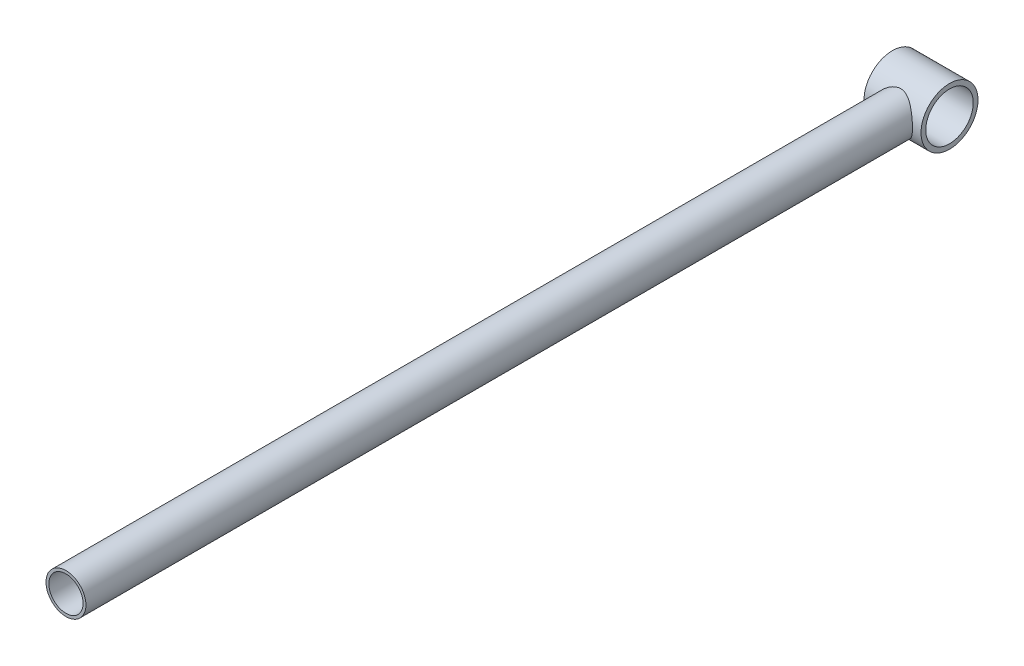
ISO-10303-21;
HEADER;
FILE_DESCRIPTION(('STEP AP214'),'2;1');
FILE_NAME('part.step','',(''),(''),'','','');
FILE_SCHEMA(('AUTOMOTIVE_DESIGN { 1 0 10303 214 1 1 1 1 }'));
ENDSEC;
DATA;
#1=APPLICATION_CONTEXT('core data for automotive mechanical design processes');
#2=APPLICATION_PROTOCOL_DEFINITION('international standard','automotive_design',2000,#1);
#3=PRODUCT_CONTEXT('',#1,'mechanical');
#4=PRODUCT('Part','Part','',(#3));
#5=PRODUCT_RELATED_PRODUCT_CATEGORY('part','',(#4));
#6=PRODUCT_DEFINITION_FORMATION('','',#4);
#7=PRODUCT_DEFINITION_CONTEXT('part definition',#1,'design');
#8=PRODUCT_DEFINITION('design','',#6,#7);
#9=PRODUCT_DEFINITION_SHAPE('','',#8);
#10=(LENGTH_UNIT() NAMED_UNIT(*) SI_UNIT(.MILLI.,.METRE.));
#11=(NAMED_UNIT(*) PLANE_ANGLE_UNIT() SI_UNIT($,.RADIAN.));
#12=(NAMED_UNIT(*) SI_UNIT($,.STERADIAN.) SOLID_ANGLE_UNIT());
#13=UNCERTAINTY_MEASURE_WITH_UNIT(LENGTH_MEASURE(1.E-05),#10,'distance_accuracy_value','');
#14=(GEOMETRIC_REPRESENTATION_CONTEXT(3) GLOBAL_UNCERTAINTY_ASSIGNED_CONTEXT((#13)) GLOBAL_UNIT_ASSIGNED_CONTEXT((#10,
#11,#12)) REPRESENTATION_CONTEXT('',''));
#15=CARTESIAN_POINT('',(0.,0.,0.));
#16=DIRECTION('',(0.,0.,1.));
#17=DIRECTION('',(1.,0.,0.));
#18=AXIS2_PLACEMENT_3D('',#15,#16,#17);
#19=CARTESIAN_POINT('',(0.,0.,900.));
#20=DIRECTION('',(0.,0.,-1.));
#21=DIRECTION('',(-1.,0.,0.));
#22=AXIS2_PLACEMENT_3D('',#19,#20,#21);
#23=CYLINDRICAL_SURFACE('',#22,21.);
#24=CARTESIAN_POINT('',(0.,0.,900.));
#25=DIRECTION('',(0.,0.,1.));
#26=DIRECTION('',(1.,0.,0.));
#27=AXIS2_PLACEMENT_3D('',#24,#25,#26);
#28=CIRCLE('',#27,21.);
#29=CARTESIAN_POINT('',(21.,0.,900.));
#30=VERTEX_POINT('',#29);
#31=EDGE_CURVE('E49',#30,#30,#28,.T.);
#32=ORIENTED_EDGE('',*,*,#31,.F.);
#33=EDGE_LOOP('',(#32));
#34=FACE_BOUND('',#33,.T.);
#35=CARTESIAN_POINT('',(-21.,0.,30.));
#36=CARTESIAN_POINT('',(-21.0000030016786,0.522139363504642,30.0000028096005));
#37=CARTESIAN_POINT('',(-20.9805018033482,1.04424378297232,29.9863417700638));
#38=CARTESIAN_POINT('',(-20.9028288134405,2.08411304662802,29.9320475904379));
#39=CARTESIAN_POINT('',(-20.8446603803,2.60187826374233,29.8914167928032));
#40=CARTESIAN_POINT('',(-20.6905610723578,3.62912317980961,29.7841613040893));
#41=CARTESIAN_POINT('',(-20.5946210870993,4.13860084892023,29.7175303418333));
#42=CARTESIAN_POINT('',(-20.3664086236415,5.14547395896201,29.5598342669698));
#43=CARTESIAN_POINT('',(-20.2341348878992,5.64286898105352,29.4687683086481));
#44=CARTESIAN_POINT('',(-19.9357924443592,6.61995875788221,29.2647235126369));
#45=CARTESIAN_POINT('',(-19.7698941299359,7.09972889319108,29.1518552887538));
#46=CARTESIAN_POINT('',(-19.4058767180977,8.04157152857023,28.9062278826493));
#47=CARTESIAN_POINT('',(-19.2077579437734,8.50364420604434,28.7734688998834));
#48=CARTESIAN_POINT('',(-18.7813353764875,9.4080499838005,28.4905792567296));
#49=CARTESIAN_POINT('',(-18.5530327874011,9.85038387041943,28.3404492892095));
#50=CARTESIAN_POINT('',(-18.0681803671967,10.7138264742398,28.0254380267442));
#51=CARTESIAN_POINT('',(-17.8116270203184,11.1349325401461,27.8605548962719));
#52=CARTESIAN_POINT('',(-17.2482943142261,11.9908926807694,27.5036730841839));
#53=CARTESIAN_POINT('',(-16.9390806650561,12.4236816666953,27.3105655343889));
#54=CARTESIAN_POINT('',(-16.2914367781881,13.2615808482145,26.9136660373409));
#55=CARTESIAN_POINT('',(-15.9530051566134,13.6666897311409,26.7098735841891));
#56=CARTESIAN_POINT('',(-15.2481596682265,14.4489165067027,26.2949628574189));
#57=CARTESIAN_POINT('',(-14.8817076195985,14.8259947733449,26.083834809561));
#58=CARTESIAN_POINT('',(-14.1226090530107,15.5507992372147,25.6583180799881));
#59=CARTESIAN_POINT('',(-13.729961024889,15.8985237396161,25.4439292108423));
#60=CARTESIAN_POINT('',(-12.8480727758939,16.6224949517664,24.9781707294449));
#61=CARTESIAN_POINT('',(-12.354002345993,16.9929738905183,24.7269402090807));
#62=CARTESIAN_POINT('',(-11.3322354242131,17.690770722502,24.2326130950016));
#63=CARTESIAN_POINT('',(-10.8045302608075,18.0180774179922,23.9895186237167));
#64=CARTESIAN_POINT('',(-9.71715664456965,18.6269818359532,23.5198450086047));
#65=CARTESIAN_POINT('',(-9.15753065407967,18.9086384514908,23.2932447969889));
#66=CARTESIAN_POINT('',(-8.29509013603358,19.294834597165,22.9725363785782));
#67=CARTESIAN_POINT('',(-8.00382784209581,19.4175007456437,22.8688482187721));
#68=CARTESIAN_POINT('',(-7.41371076354774,19.6503825262825,22.6690535406029));
#69=CARTESIAN_POINT('',(-7.11485421500728,19.7605952328771,22.5729488053327));
#70=CARTESIAN_POINT('',(-6.39612362173446,20.0070791920212,22.3551581744265));
#71=CARTESIAN_POINT('',(-5.97302255802356,20.1375536535112,22.2374516540968));
#72=CARTESIAN_POINT('',(-5.11468671401496,20.3724784759791,22.0224319526899));
#73=CARTESIAN_POINT('',(-4.67945558084695,20.4769365673737,21.925112715173));
#74=CARTESIAN_POINT('',(-3.79939196121188,20.65831771735,21.7542972490663));
#75=CARTESIAN_POINT('',(-3.35457615063467,20.7352850578524,21.6807627264235));
#76=CARTESIAN_POINT('',(-2.45734056009086,20.8606477258805,21.5601713050939));
#77=CARTESIAN_POINT('',(-2.00492079720528,20.9090431175797,21.5131143469377));
#78=CARTESIAN_POINT('',(-1.09315844954929,20.9765380721417,21.4473103354131));
#79=CARTESIAN_POINT('',(-0.633790900793574,20.9954655353593,21.4287295996627));
#80=CARTESIAN_POINT('',(0.285438297298884,21.0030898024577,21.4212569782211));
#81=CARTESIAN_POINT('',(0.74529994480372,20.9917867180363,21.4323649828341));
#82=CARTESIAN_POINT('',(1.66190989374096,20.9391724994902,21.4837702004158));
#83=CARTESIAN_POINT('',(2.11865617281979,20.8978434563318,21.5240848336873));
#84=CARTESIAN_POINT('',(3.02523827126227,20.7859705480368,21.632138936961));
#85=CARTESIAN_POINT('',(3.47507394681526,20.7154260757748,21.6998789768896));
#86=CARTESIAN_POINT('',(4.33532127559099,20.5519778005734,21.8547011059896));
#87=CARTESIAN_POINT('',(4.7463658811044,20.4608720169539,21.9401981370793));
#88=CARTESIAN_POINT('',(5.55828066479709,20.2553932784216,22.1300383090195));
#89=CARTESIAN_POINT('',(5.959147043663,20.1410117747261,22.2343883726898));
#90=CARTESIAN_POINT('',(6.74949919036072,19.8901050092372,22.4591199814558));
#91=CARTESIAN_POINT('',(7.13897869769433,19.7535678267552,22.5795101505298));
#92=CARTESIAN_POINT('',(7.90540017899447,19.4595251934198,22.8334102113169));
#93=CARTESIAN_POINT('',(8.2823440694059,19.3020229662918,22.9669180851392));
#94=CARTESIAN_POINT('',(9.21983705503104,18.8780790475413,23.3179932659974));
#95=CARTESIAN_POINT('',(9.77171796608896,18.5981674550038,23.5425843204367));
#96=CARTESIAN_POINT('',(10.8438857080031,17.9941389131174,24.0074221440567));
#97=CARTESIAN_POINT('',(11.3641595085085,17.6700039085722,24.2476752866055));
#98=CARTESIAN_POINT('',(12.3729032339043,16.9789766443065,24.7364869213433));
#99=CARTESIAN_POINT('',(12.861314417595,16.6120087082098,24.9850595424287));
#100=CARTESIAN_POINT('',(13.8040207225899,15.837334919501,25.4831492444279));
#101=CARTESIAN_POINT('',(14.2583201989205,15.429634282757,25.7326662004917));
#102=CARTESIAN_POINT('',(15.136441554028,14.5694995976463,26.229358403613));
#103=CARTESIAN_POINT('',(15.5598320196401,14.1165872352544,26.4764695667978));
#104=CARTESIAN_POINT('',(16.3676492082307,13.1714310594696,26.9591370786845));
#105=CARTESIAN_POINT('',(16.7520723023711,12.6791835906127,27.1946923501915));
#106=CARTESIAN_POINT('',(17.4782461801882,11.6577286804088,27.647943464369));
#107=CARTESIAN_POINT('',(17.8200725721641,11.1285894028624,27.8656707088055));
#108=CARTESIAN_POINT('',(18.2984438720732,10.3085943701031,28.1747814447172));
#109=CARTESIAN_POINT('',(18.452163522779,10.0309016978793,28.2748987097707));
#110=CARTESIAN_POINT('',(18.7477441015681,9.46696671750889,28.4686747347568));
#111=CARTESIAN_POINT('',(18.8896020017362,9.18072225152697,28.5623318445623));
#112=CARTESIAN_POINT('',(19.236502252626,8.43835836584836,28.7926731907843));
#113=CARTESIAN_POINT('',(19.4327037015834,7.97646237276238,28.9242514064532));
#114=CARTESIAN_POINT('',(19.7928905534157,7.03529153377132,29.1674626727303));
#115=CARTESIAN_POINT('',(19.9568824536785,6.55602021601318,29.2790997455017));
#116=CARTESIAN_POINT('',(20.2506998866761,5.58277389644747,29.480152102592));
#117=CARTESIAN_POINT('',(20.3805413949854,5.0888058905733,29.5695777763237));
#118=CARTESIAN_POINT('',(20.6044138323331,4.08907213293505,29.7243220362663));
#119=CARTESIAN_POINT('',(20.6984440326398,3.58330614131359,29.7896401319064));
#120=CARTESIAN_POINT('',(20.8496160317771,2.56150542084761,29.894874568425));
#121=CARTESIAN_POINT('',(20.9066046375167,2.0454370320149,29.9346854092819));
#122=CARTESIAN_POINT('',(20.9821729740576,1.0091186162172,29.9875115613899));
#123=CARTESIAN_POINT('',(21.0007527110704,0.488868589928469,30.0005268769744));
#124=CARTESIAN_POINT('',(20.9992005482234,-0.551528121854273,29.9994404045402));
#125=CARTESIAN_POINT('',(20.9790697363269,-1.07167480984172,29.9853393786286));
#126=CARTESIAN_POINT('',(20.9004258925435,-2.10760905173202,29.9303693639773));
#127=CARTESIAN_POINT('',(20.8419142396888,-2.62339676157953,29.889501336982));
#128=CARTESIAN_POINT('',(20.6924977935693,-3.61308880982631,29.7855132567241));
#129=CARTESIAN_POINT('',(20.6039617209437,-4.08752624893559,29.7240232475498));
#130=CARTESIAN_POINT('',(20.3953347128018,-5.0260730366639,29.5797903571606));
#131=CARTESIAN_POINT('',(20.2752454400586,-5.49018292812081,29.497048595864));
#132=CARTESIAN_POINT('',(20.0049238976076,-6.4055288270512,29.3118966579764));
#133=CARTESIAN_POINT('',(19.8546891099268,-6.85676375551546,29.2094848384296));
#134=CARTESIAN_POINT('',(19.5256728492025,-7.74416402227739,28.9868458709253));
#135=CARTESIAN_POINT('',(19.3468897936758,-8.1803285235623,28.8666177354031));
#136=CARTESIAN_POINT('',(18.9488548103376,-9.06603463904474,28.6013207239606));
#137=CARTESIAN_POINT('',(18.727636628259,-9.51434581809408,28.4550972121009));
#138=CARTESIAN_POINT('',(18.256384470974,-10.3899799262107,28.1471802744837));
#139=CARTESIAN_POINT('',(18.0063494396476,-10.8173020852242,27.9854862817795));
#140=CARTESIAN_POINT('',(17.4792195087191,-11.6498827956824,27.6492654799792));
#141=CARTESIAN_POINT('',(17.2021125826037,-12.0551314154441,27.4747329760417));
#142=CARTESIAN_POINT('',(16.6225878658483,-12.8424515914298,27.115654093724));
#143=CARTESIAN_POINT('',(16.3201670993105,-13.2245204135021,26.9311065388728));
#144=CARTESIAN_POINT('',(15.637707186282,-14.0280238180896,26.5226477926847));
#145=CARTESIAN_POINT('',(15.2532368962608,-14.4450231309386,26.2974004065562));
#146=CARTESIAN_POINT('',(14.4534314724557,-15.2452758647429,25.8417033982012));
#147=CARTESIAN_POINT('',(14.0380919072556,-15.6285244233128,25.6112530323835));
#148=CARTESIAN_POINT('',(13.1776643009478,-16.360577068066,25.1499268775914));
#149=CARTESIAN_POINT('',(12.7325534631647,-16.7093542403453,24.9190508973492));
#150=CARTESIAN_POINT('',(11.8139446786733,-17.3709836244724,24.4624291437159));
#151=CARTESIAN_POINT('',(11.3404499563073,-17.6838399051218,24.2366827916138));
#152=CARTESIAN_POINT('',(10.4125110066118,-18.2440275445785,23.8173448179944));
#153=CARTESIAN_POINT('',(9.9605791901329,-18.4947642720405,23.622743337259));
#154=CARTESIAN_POINT('',(9.03472270692457,-18.9642600857899,23.2475190279739));
#155=CARTESIAN_POINT('',(8.56079746938568,-19.1830183415071,23.0668965625555));
#156=CARTESIAN_POINT('',(7.5926617008033,-19.5863736781477,22.7253980131195));
#157=CARTESIAN_POINT('',(7.09848473144647,-19.7710246911012,22.5644908922822));
#158=CARTESIAN_POINT('',(6.0907452984859,-20.1043337565574,22.2680395809845));
#159=CARTESIAN_POINT('',(5.57718809221115,-20.2530014903564,22.1324885707004));
#160=CARTESIAN_POINT('',(4.6389198553431,-20.4857140606324,21.9170100309722));
#161=CARTESIAN_POINT('',(4.21724652364094,-20.5767476056501,21.8313773767555));
#162=CARTESIAN_POINT('',(3.36519645784325,-20.7331369070813,21.6829127076127));
#163=CARTESIAN_POINT('',(2.93482084964832,-20.7984959631903,21.6200777627953));
#164=CARTESIAN_POINT('',(2.06839032609777,-20.9024378178356,21.519603758078));
#165=CARTESIAN_POINT('',(1.6323422125398,-20.941050126998,21.4819369309395));
#166=CARTESIAN_POINT('',(0.757177305160306,-20.990920927013,21.4332096217729));
#167=CARTESIAN_POINT('',(0.318060480902294,-21.0021791461715,21.4221494040144));
#168=CARTESIAN_POINT('',(-0.560383803578687,-20.9971217966341,21.4271063691283));
#169=CARTESIAN_POINT('',(-0.999710889621124,-20.9807733000154,21.4431558871568));
#170=CARTESIAN_POINT('',(-1.87468784242075,-20.9207521129018,21.5017177088797));
#171=CARTESIAN_POINT('',(-2.31033773156066,-20.8770795888472,21.5442298513808));
#172=CARTESIAN_POINT('',(-3.17549794973413,-20.7631126204946,21.6540848459456));
#173=CARTESIAN_POINT('',(-3.60499989404334,-20.6927848586031,21.7214587710885));
#174=CARTESIAN_POINT('',(-4.45486414474633,-20.5266109606012,21.8785573791153));
#175=CARTESIAN_POINT('',(-4.87522522731318,-20.4307614299789,21.9682850350453));
#176=CARTESIAN_POINT('',(-5.82218439689123,-20.1842612618693,22.195293271751));
#177=CARTESIAN_POINT('',(-6.34524883185518,-20.0257787123513,22.3388467699985));
#178=CARTESIAN_POINT('',(-7.37069852021808,-19.6714855305921,22.651454535761));
#179=CARTESIAN_POINT('',(-7.8730774130996,-19.4756635196791,22.8205165733556));
#180=CARTESIAN_POINT('',(-8.85615081096811,-19.0487822705998,23.1780385843898));
#181=CARTESIAN_POINT('',(-9.33681899969305,-18.817681680812,23.3665212362249));
#182=CARTESIAN_POINT('',(-10.2749199541703,-18.3223196009062,23.7569368799941));
#183=CARTESIAN_POINT('',(-10.7323540793603,-18.0580600540838,23.9588690833859));
#184=CARTESIAN_POINT('',(-11.633977181546,-17.4911647214488,24.375928795016));
#185=CARTESIAN_POINT('',(-12.0775938088268,-17.1877667390505,24.5912557642087));
#186=CARTESIAN_POINT('',(-12.9391353264947,-16.5489086065067,25.0256439438005));
#187=CARTESIAN_POINT('',(-13.3570603447144,-16.2134486159118,25.2447051356125));
#188=CARTESIAN_POINT('',(-14.1664241146984,-15.5112705037231,25.6821266605216));
#189=CARTESIAN_POINT('',(-14.5578552209222,-15.1445434275675,25.9004867741327));
#190=CARTESIAN_POINT('',(-15.3128761722056,-14.3806899507618,26.3322672598208));
#191=CARTESIAN_POINT('',(-15.6764630372895,-13.9835603054054,26.545687101474));
#192=CARTESIAN_POINT('',(-16.438475496301,-13.0837742184306,27.0021103117724));
#193=CARTESIAN_POINT('',(-16.8309782931605,-12.5751557375068,27.2433198671589));
#194=CARTESIAN_POINT('',(-17.571287916976,-11.5180814795311,27.7068022474635));
#195=CARTESIAN_POINT('',(-17.9190879862317,-10.9696196989461,27.92907220758));
#196=CARTESIAN_POINT('',(-18.5655925322006,-9.83586246046007,28.3482048450996));
#197=CARTESIAN_POINT('',(-18.8643381285387,-9.25059842692598,28.5450887721546));
#198=CARTESIAN_POINT('',(-19.4084807931639,-8.04654966069242,28.9075758155444));
#199=CARTESIAN_POINT('',(-19.6538929268033,-7.42777445590566,29.0731877636833));
#200=CARTESIAN_POINT('',(-20.0541832050944,-6.25721006317298,29.3453941761765));
#201=CARTESIAN_POINT('',(-20.217129527181,-5.7093653473698,29.4571204218519));
#202=CARTESIAN_POINT('',(-20.4986366716474,-4.59725305414212,29.6510314454142));
#203=CARTESIAN_POINT('',(-20.6172021189562,-4.03298719457284,29.7332193014598));
#204=CARTESIAN_POINT('',(-20.8077082327473,-2.8935417141935,29.8656330167248));
#205=CARTESIAN_POINT('',(-20.8796983715023,-2.3183743438364,29.9158927889105));
#206=CARTESIAN_POINT('',(-20.9758405302026,-1.16212321643655,29.9830732852714));
#207=CARTESIAN_POINT('',(-20.9999966597131,-0.581039971956366,29.9999968734589));
#208=CARTESIAN_POINT('',(-21.,0.,30.));
#209=B_SPLINE_CURVE_WITH_KNOTS('',3,(#35,#36,#37,#38,#39,#40,#41,#42,#43,#44,#45,#46,#47,#48,
#49,#50,#51,#52,#53,#54,#55,#56,#57,#58,#59,#60,#61,#62,#63,#64,#65,#66,#67,#68,#69,#70,#71,#72,
#73,#74,#75,#76,#77,#78,#79,#80,#81,#82,#83,#84,#85,#86,#87,#88,#89,#90,#91,#92,#93,#94,#95,#96,
#97,#98,#99,#100,#101,#102,#103,#104,#105,#106,#107,#108,#109,#110,#111,#112,#113,#114,#115,
#116,#117,#118,#119,#120,#121,#122,#123,#124,#125,#126,#127,#128,#129,#130,#131,#132,#133,#134,
#135,#136,#137,#138,#139,#140,#141,#142,#143,#144,#145,#146,#147,#148,#149,#150,#151,#152,#153,
#154,#155,#156,#157,#158,#159,#160,#161,#162,#163,#164,#165,#166,#167,#168,#169,#170,#171,#172,
#173,#174,#175,#176,#177,#178,#179,#180,#181,#182,#183,#184,#185,#186,#187,#188,#189,#190,#191,
#192,#193,#194,#195,#196,#197,#198,#199,#200,#201,#202,#203,#204,#205,#206,#207,#208),
.UNSPECIFIED.,.T.,.F.,(4,2,2,2,2,2,2,2,2,2,2,2,2,2,2,2,2,2,2,2,2,2,2,2,2,2,2,2,2,2,2,2,2,2,2,2,
2,2,2,2,2,2,2,2,2,2,2,2,2,2,2,2,2,2,2,2,2,2,2,2,2,2,2,2,2,2,2,2,2,2,2,2,2,2,2,2,2,2,2,2,2,2,2,2,
2,2,4),(0.,1.56582024750205,3.13150451369805,4.69756665280387,6.26368300152248,7.82205299786193,
9.38040736861309,10.9386996034686,12.4971859848665,14.1931766310765,15.8892476501058,
17.5876724684341,19.2861952833561,21.2839576357884,23.2822371404197,25.277917788053,
26.2754190251758,27.273154110473,28.6462722944093,30.0189819865594,31.3894704476345,
32.7599558305455,34.1384155406343,35.5168701575093,36.8961476316751,38.2754537700303,
39.5630726172669,40.8511652417266,42.1399532263754,43.4285432668102,45.400654858582,
47.3735740318977,49.3500332420786,51.3262396880363,53.326173164234,55.3262927135487,
57.3228099321013,58.3209311028378,59.3193062882042,60.8740223522875,62.4284244724651,
63.9820981438221,65.5358034295109,67.0958941713692,68.6559846609343,70.2160313046693,
71.7760218986512,73.233991228657,74.6918837428041,76.1498980814791,77.6079932686481,
79.1690559350298,80.7301758316071,82.2919924267384,83.8539928877606,85.6830054219923,
87.5122810278116,89.3429737609573,91.1734589243873,92.8287910433424,94.4841661482588,
96.1369008565309,97.7891904012264,99.1073078836029,100.425255905521,101.741747462918,
103.058252096299,104.376328100557,105.694396076029,107.014117027125,108.334013594893,
110.026762482734,111.720028038594,113.415293807604,115.110460271164,116.845875110838,
118.581281314986,120.317186201332,122.053276610644,124.109220019975,126.165473861134,
128.219995161816,130.273935355749,132.018577587401,133.763037959312,135.505642310654,
137.248096943055),.UNSPECIFIED.);
#210=CARTESIAN_POINT('',(-21.,0.,30.));
#211=VERTEX_POINT('',#210);
#212=EDGE_CURVE('E10',#211,#211,#209,.T.);
#213=ORIENTED_EDGE('',*,*,#212,.F.);
#214=EDGE_LOOP('',(#213));
#215=FACE_BOUND('',#214,.T.);
#216=ADVANCED_FACE('F33',(#34,#215),#23,.T.);
#217=CARTESIAN_POINT('',(0.,0.,900.));
#218=DIRECTION('',(0.,0.,-1.));
#219=DIRECTION('',(-1.,0.,0.));
#220=AXIS2_PLACEMENT_3D('',#217,#218,#219);
#221=CYLINDRICAL_SURFACE('',#220,18.);
#222=CARTESIAN_POINT('',(0.,0.,900.));
#223=DIRECTION('',(0.,0.,-1.));
#224=DIRECTION('',(-1.,0.,0.));
#225=AXIS2_PLACEMENT_3D('',#222,#223,#224);
#226=CIRCLE('',#225,18.);
#227=CARTESIAN_POINT('',(-18.,0.,900.));
#228=VERTEX_POINT('',#227);
#229=EDGE_CURVE('E56',#228,#228,#226,.T.);
#230=ORIENTED_EDGE('',*,*,#229,.F.);
#231=EDGE_LOOP('',(#230));
#232=FACE_BOUND('',#231,.T.);
#233=CARTESIAN_POINT('',(-18.,0.,30.));
#234=CARTESIAN_POINT('',(-17.999996247715,-0.4606123178426,29.9999965033915));
#235=CARTESIAN_POINT('',(-17.9822921362072,-0.921341104850186,29.9893649266002));
#236=CARTESIAN_POINT('',(-17.911700896493,-1.83932264715951,29.9470908900286));
#237=CARTESIAN_POINT('',(-17.8587931824861,-2.29657321019135,29.9154361366709));
#238=CARTESIAN_POINT('',(-17.7183641285956,-3.20487010694028,29.8318158697663));
#239=CARTESIAN_POINT('',(-17.6307675458938,-3.65590073368428,29.7798062077528));
#240=CARTESIAN_POINT('',(-17.4221309636962,-4.54740994379331,29.6567624509548));
#241=CARTESIAN_POINT('',(-17.3010955154834,-4.98788995431719,29.5857309452278));
#242=CARTESIAN_POINT('',(-17.0277165263829,-5.85335853126847,29.4267027939977));
#243=CARTESIAN_POINT('',(-16.8755318341814,-6.27841329800556,29.3387923598966));
#244=CARTESIAN_POINT('',(-16.5410982375724,-7.11295835128677,29.1477117701425));
#245=CARTESIAN_POINT('',(-16.358848421334,-7.5224481653053,29.0445411516805));
#246=CARTESIAN_POINT('',(-15.9660494100785,-8.32371793921731,28.8251315609232));
#247=CARTESIAN_POINT('',(-15.7555121728485,-8.71550528936686,28.7088981139832));
#248=CARTESIAN_POINT('',(-15.3077111611957,-9.47999294803696,28.4656053285681));
#249=CARTESIAN_POINT('',(-15.0704446260552,-9.85269127916741,28.3385448721631));
#250=CARTESIAN_POINT('',(-14.5516473760924,-10.6053828640279,28.065959098076));
#251=CARTESIAN_POINT('',(-14.2681197029592,-10.9837574648452,27.9197647225183));
#252=CARTESIAN_POINT('',(-13.6736671760443,-11.7155056512045,27.6207020921481));
#253=CARTESIAN_POINT('',(-13.3627411295882,-12.0688781471754,27.4678335469497));
#254=CARTESIAN_POINT('',(-12.7146537797534,-12.7498541948097,27.1584469883917));
#255=CARTESIAN_POINT('',(-12.3774612885572,-13.0774261548348,27.0019247960698));
#256=CARTESIAN_POINT('',(-11.6785292766803,-13.7052047452077,26.6887697615136));
#257=CARTESIAN_POINT('',(-11.3167884235925,-14.005409888096,26.5321369137305));
#258=CARTESIAN_POINT('',(-10.5241107680157,-14.6123897313171,26.2032698900104));
#259=CARTESIAN_POINT('',(-10.090131019659,-14.9154464446633,26.0314810804456));
#260=CARTESIAN_POINT('',(-9.19438804871581,-15.4836871664193,25.6975501856673));
#261=CARTESIAN_POINT('',(-8.73262025527079,-15.7488649197798,25.5354096962786));
#262=CARTESIAN_POINT('',(-7.7838746717016,-16.2387169807848,25.2267278102565));
#263=CARTESIAN_POINT('',(-7.29693088929787,-16.4634441793876,25.0801661478498));
#264=CARTESIAN_POINT('',(-6.29982343600646,-16.8701465661734,24.8084270169342));
#265=CARTESIAN_POINT('',(-5.78966851553725,-17.0521377086867,24.6832415729796));
#266=CARTESIAN_POINT('',(-4.87525343582019,-17.332112289161,24.4871313161555));
#267=CARTESIAN_POINT('',(-4.47517706726099,-17.4397693440726,24.4104038340108));
#268=CARTESIAN_POINT('',(-3.66563898116245,-17.6276958350911,24.2750445658924));
#269=CARTESIAN_POINT('',(-3.25617872129837,-17.7079694945177,24.2164099895972));
#270=CARTESIAN_POINT('',(-2.43075519103568,-17.8400091103401,24.1193036914813));
#271=CARTESIAN_POINT('',(-2.01479930561616,-17.891805316614,24.0808105767106));
#272=CARTESIAN_POINT('',(-1.1788348425544,-17.9662579457428,24.0253148039202));
#273=CARTESIAN_POINT('',(-0.758826195277771,-17.988913867009,24.00831251582));
#274=CARTESIAN_POINT('',(0.0828910592227182,-18.0047399120302,23.9964464946916));
#275=CARTESIAN_POINT('',(0.504601385296466,-17.9978518994625,24.0016264116015));
#276=CARTESIAN_POINT('',(1.3456435868693,-17.9545693478354,24.0340208362415));
#277=CARTESIAN_POINT('',(1.76497545080206,-17.9181746654103,24.0612354510327));
#278=CARTESIAN_POINT('',(2.59844448243044,-17.8164103550854,24.1366839374855));
#279=CARTESIAN_POINT('',(3.01257812961375,-17.7510220762816,24.1849313387106));
#280=CARTESIAN_POINT('',(3.83266134786201,-17.5921908011246,24.3007088398253));
#281=CARTESIAN_POINT('',(4.23861072958553,-17.4987471565089,24.3682393852799));
#282=CARTESIAN_POINT('',(5.03472685523363,-17.2863824194063,24.5193333126742));
#283=CARTESIAN_POINT('',(5.4250316358087,-17.167816347306,24.6026717412529));
#284=CARTESIAN_POINT('',(6.19389910981274,-16.9056403069907,24.7835566187832));
#285=CARTESIAN_POINT('',(6.5724570329468,-16.7620203173983,24.8811087505259));
#286=CARTESIAN_POINT('',(7.31633017019501,-16.4509529012938,25.0878657233905));
#287=CARTESIAN_POINT('',(7.68164554221251,-16.2835057590124,25.1970704255065));
#288=CARTESIAN_POINT('',(8.39803374750236,-15.9258704216511,25.4246253783133));
#289=CARTESIAN_POINT('',(8.74910483292227,-15.7356794470121,25.5429767462058));
#290=CARTESIAN_POINT('',(9.49622432455917,-15.2983793746741,25.8076695266055));
#291=CARTESIAN_POINT('',(9.88940412212109,-15.0471327319787,25.9552867391066));
#292=CARTESIAN_POINT('',(10.653718521476,-14.5160219044404,26.2560136464046));
#293=CARTESIAN_POINT('',(11.0248512063092,-14.2361552368747,26.4091238169542));
#294=CARTESIAN_POINT('',(11.7442244300632,-13.6487724983064,26.7174307980583));
#295=CARTESIAN_POINT('',(12.0924448666736,-13.3412326935252,26.8726293007691));
#296=CARTESIAN_POINT('',(12.7644150128457,-12.6998217577106,27.1816349442744));
#297=CARTESIAN_POINT('',(13.088163348339,-12.3659491502811,27.3354420065156));
#298=CARTESIAN_POINT('',(13.7532165070047,-11.6245602348295,27.6596325859201));
#299=CARTESIAN_POINT('',(14.0906641278745,-11.2132695142636,27.8293331835911));
#300=CARTESIAN_POINT('',(14.7296330266614,-10.3596410896415,28.1582505120647));
#301=CARTESIAN_POINT('',(15.0311505097486,-9.9173001139797,28.3174661346837));
#302=CARTESIAN_POINT('',(15.5954409108431,-9.00390222786905,28.6209927681811));
#303=CARTESIAN_POINT('',(15.8582279726905,-8.53285588951029,28.7653092142472));
#304=CARTESIAN_POINT('',(16.3422308910258,-7.56467339268615,29.0349464169933));
#305=CARTESIAN_POINT('',(16.5634519071941,-7.06754048221539,29.1602695309814));
#306=CARTESIAN_POINT('',(16.9488126212194,-6.08271837441072,29.3809276388282));
#307=CARTESIAN_POINT('',(17.1156694323957,-5.59640555342153,29.4776539987173));
#308=CARTESIAN_POINT('',(17.4079378731788,-4.60754165415758,29.6483086690556));
#309=CARTESIAN_POINT('',(17.5333506922953,-4.10499104238822,29.7222376338227));
#310=CARTESIAN_POINT('',(17.7406334768814,-3.0884810754452,29.8449845539788));
#311=CARTESIAN_POINT('',(17.8225468411623,-2.57453362622368,29.893827535706));
#312=CARTESIAN_POINT('',(17.9415868016472,-1.53967891199694,29.9649500598075));
#313=CARTESIAN_POINT('',(17.9787196970194,-1.01877263629972,29.9872333382706));
#314=CARTESIAN_POINT('',(18.005591952429,-0.0462685918822822,30.0033547950519));
#315=CARTESIAN_POINT('',(18.0010874972385,0.405125350985292,30.000647839328));
#316=CARTESIAN_POINT('',(17.9582383243715,1.30568921144754,29.9749564806596));
#317=CARTESIAN_POINT('',(17.919897305146,1.75485936671404,29.9519742938666));
#318=CARTESIAN_POINT('',(17.8098981441931,2.64760780131615,29.8862934190204));
#319=CARTESIAN_POINT('',(17.7382410055998,3.09118624860269,29.8435953246048));
#320=CARTESIAN_POINT('',(17.5625344843759,3.9696387603464,29.7394958187237));
#321=CARTESIAN_POINT('',(17.4584842974777,4.40451260839694,29.678093942874));
#322=CARTESIAN_POINT('',(17.222166086546,5.25222627963508,29.5397032540844));
#323=CARTESIAN_POINT('',(17.0906498414912,5.66534485796348,29.4631320533819));
#324=CARTESIAN_POINT('',(16.7993361889527,6.47833032114859,29.2951112248471));
#325=CARTESIAN_POINT('',(16.6395396430595,6.87819760927993,29.2036620502955));
#326=CARTESIAN_POINT('',(16.293106163651,7.66280786470712,29.0076698350565));
#327=CARTESIAN_POINT('',(16.1064677049152,8.04754997097167,28.9031260503462));
#328=CARTESIAN_POINT('',(15.7078098991987,8.80035021087738,28.6828814469052));
#329=CARTESIAN_POINT('',(15.495787501539,9.16840633182944,28.5671792874702));
#330=CARTESIAN_POINT('',(15.0245479021728,9.92376621929537,28.3141927532757));
#331=CARTESIAN_POINT('',(14.7627165820063,10.3091072883145,28.1759145582784));
#332=CARTESIAN_POINT('',(14.2116479628749,11.0564303652402,27.8911328116259));
#333=CARTESIAN_POINT('',(13.9224090736259,11.4184110156417,27.7446287828801));
#334=CARTESIAN_POINT('',(13.3177935372798,12.1181852114409,27.4462095709139));
#335=CARTESIAN_POINT('',(13.0023893399048,12.4559525462942,27.2942887826659));
#336=CARTESIAN_POINT('',(12.3471137569034,13.1057902101801,26.988280309576));
#337=CARTESIAN_POINT('',(12.0072413400486,13.4178594549609,26.8341925336257));
#338=CARTESIAN_POINT('',(11.2583754277471,14.0542116603897,26.5070412073355));
#339=CARTESIAN_POINT('',(10.8461485102126,14.3747782579421,26.3341241331038));
#340=CARTESIAN_POINT('',(9.9936051777929,14.9800282692751,25.9945996596464));
#341=CARTESIAN_POINT('',(9.55328425898516,15.2647059075953,25.8279932789843));
#342=CARTESIAN_POINT('',(8.64653172631376,15.7959878793511,25.506530207123));
#343=CARTESIAN_POINT('',(8.1801219895411,16.0426234800489,25.351663920403));
#344=CARTESIAN_POINT('',(7.46248889343956,16.3823476387754,25.1323868410131));
#345=CARTESIAN_POINT('',(7.22029484022182,16.4905433842038,25.0614700165414));
#346=CARTESIAN_POINT('',(6.73007458872087,16.6966106486408,24.9246561306117));
#347=CARTESIAN_POINT('',(6.48204688450417,16.7944794652154,24.8587603843573));
#348=CARTESIAN_POINT('',(5.8382219105666,17.0320478568118,24.6969669648524));
#349=CARTESIAN_POINT('',(5.43844862947962,17.1639648735585,24.6052667899836));
#350=CARTESIAN_POINT('',(4.62745216416065,17.4001442748445,24.4388190799271));
#351=CARTESIAN_POINT('',(4.21623150312647,17.5044127011018,24.364067841608));
#352=CARTESIAN_POINT('',(3.38493836903702,17.6839691444646,24.2340574620378));
#353=CARTESIAN_POINT('',(2.96487654726441,17.7592901394557,24.1787761460372));
#354=CARTESIAN_POINT('',(2.11820147061632,17.8800465247468,24.0896160188645));
#355=CARTESIAN_POINT('',(1.6915881775044,17.925481740556,24.0557373326535));
#356=CARTESIAN_POINT('',(0.833358807838076,17.9858625013021,24.0106267374534));
#357=CARTESIAN_POINT('',(0.401729858210975,18.0006911289503,23.9994816728844));
#358=CARTESIAN_POINT('',(-0.461447371698781,17.9992593407183,24.0005554756995));
#359=CARTESIAN_POINT('',(-0.892995651838325,17.9829988701983,24.0127743841465));
#360=CARTESIAN_POINT('',(-1.75274654663447,17.9196479441891,24.0600864804087));
#361=CARTESIAN_POINT('',(-2.18094747209889,17.8725428265241,24.095190546777));
#362=CARTESIAN_POINT('',(-3.03059560537146,17.7482350812129,24.1868991065873));
#363=CARTESIAN_POINT('',(-3.45204278528462,17.6710323292879,24.243503688809));
#364=CARTESIAN_POINT('',(-4.26517619386884,17.4920869224608,24.3729038238261));
#365=CARTESIAN_POINT('',(-4.6573140075784,17.3917174104485,24.4447800475106));
#366=CARTESIAN_POINT('',(-5.43117710037227,17.1658048848771,24.603947283877));
#367=CARTESIAN_POINT('',(-5.81289896188327,17.0402537191735,24.691243287363));
#368=CARTESIAN_POINT('',(-6.56429598972532,16.7651459254565,24.8788581333908));
#369=CARTESIAN_POINT('',(-6.93397032338287,16.6155876423893,24.9791778736994));
#370=CARTESIAN_POINT('',(-7.66007096180692,16.2935897853204,25.1903949871));
#371=CARTESIAN_POINT('',(-8.01649668944537,16.1211492160259,25.3012928202399));
#372=CARTESIAN_POINT('',(-8.76888223090374,15.7262169397724,25.5489418775315));
#373=CARTESIAN_POINT('',(-9.16249924052252,15.500106017629,25.6870470574142));
#374=CARTESIAN_POINT('',(-9.92960062937082,15.0202433013703,25.9705591342003));
#375=CARTESIAN_POINT('',(-10.3030880214526,14.7664956609847,26.1159649320731));
#376=CARTESIAN_POINT('',(-11.0292649035093,14.2323098110062,26.4108785028739));
#377=CARTESIAN_POINT('',(-11.3819370156683,13.9518497969227,26.5603895547133));
#378=CARTESIAN_POINT('',(-12.0650935920915,13.3654845474407,26.8602360904772));
#379=CARTESIAN_POINT('',(-12.39557664373,13.0595776947866,27.0105716262331));
#380=CARTESIAN_POINT('',(-13.085340868941,12.3712747489538,27.3334715242438));
#381=CARTESIAN_POINT('',(-13.4404990233162,11.9845493398531,27.5056525264127));
#382=CARTESIAN_POINT('',(-14.1171468004543,11.1795642122438,27.8425528948294));
#383=CARTESIAN_POINT('',(-14.438632331231,10.7613006717357,28.007271352832));
#384=CARTESIAN_POINT('',(-15.0456476130668,9.89486635399953,28.3249819646366));
#385=CARTESIAN_POINT('',(-15.3311595170154,9.44668089938167,28.4779682833163));
#386=CARTESIAN_POINT('',(-15.8633022712715,8.52289209939821,28.767943765153));
#387=CARTESIAN_POINT('',(-16.1099379900347,8.04729219734112,28.9049349308215));
#388=CARTESIAN_POINT('',(-16.5545817378815,7.08642582645766,29.1551272139967));
#389=CARTESIAN_POINT('',(-16.7538437953555,6.60189697958196,29.2689266374981));
#390=CARTESIAN_POINT('',(-17.1105364175434,5.61300182374022,29.4745517000758));
#391=CARTESIAN_POINT('',(-17.2679599994396,5.10863221946914,29.5663736708739));
#392=CARTESIAN_POINT('',(-17.5380508203499,4.08601914212619,29.7249274538827));
#393=CARTESIAN_POINT('',(-17.650865014456,3.56782732875921,29.7917416088893));
#394=CARTESIAN_POINT('',(-17.8304675800935,2.52110015295405,29.8985001628716));
#395=CARTESIAN_POINT('',(-17.8972942847486,1.99257378383849,29.9384669399614));
#396=CARTESIAN_POINT('',(-17.9603501175506,1.21874406149269,29.9762237251747));
#397=CARTESIAN_POINT('',(-17.9752109287471,0.975338609892507,29.9851321672757));
#398=CARTESIAN_POINT('',(-17.9950370354485,0.487966345877358,29.9970213336269));
#399=CARTESIAN_POINT('',(-18.0000019876927,0.243999514283498,30.0000018522535));
#400=CARTESIAN_POINT('',(-18.,0.,30.));
#401=B_SPLINE_CURVE_WITH_KNOTS('',3,(#233,#234,#235,#236,#237,#238,#239,#240,#241,#242,#243,
#244,#245,#246,#247,#248,#249,#250,#251,#252,#253,#254,#255,#256,#257,#258,#259,#260,#261,#262,
#263,#264,#265,#266,#267,#268,#269,#270,#271,#272,#273,#274,#275,#276,#277,#278,#279,#280,#281,
#282,#283,#284,#285,#286,#287,#288,#289,#290,#291,#292,#293,#294,#295,#296,#297,#298,#299,#300,
#301,#302,#303,#304,#305,#306,#307,#308,#309,#310,#311,#312,#313,#314,#315,#316,#317,#318,#319,
#320,#321,#322,#323,#324,#325,#326,#327,#328,#329,#330,#331,#332,#333,#334,#335,#336,#337,#338,
#339,#340,#341,#342,#343,#344,#345,#346,#347,#348,#349,#350,#351,#352,#353,#354,#355,#356,#357,
#358,#359,#360,#361,#362,#363,#364,#365,#366,#367,#368,#369,#370,#371,#372,#373,#374,#375,#376,
#377,#378,#379,#380,#381,#382,#383,#384,#385,#386,#387,#388,#389,#390,#391,#392,#393,#394,#395,
#396,#397,#398,#399,#400),.UNSPECIFIED.,.T.,.F.,(4,2,2,2,2,2,2,2,2,2,2,2,2,2,2,2,2,2,2,2,2,2,2,
2,2,2,2,2,2,2,2,2,2,2,2,2,2,2,2,2,2,2,2,2,2,2,2,2,2,2,2,2,2,2,2,2,2,2,2,2,2,2,2,2,2,2,2,2,2,2,2,
2,2,2,2,2,2,2,2,2,2,2,2,4),(0.,1.38157980343825,2.76396821590316,4.14937170471817,
5.5345867224384,6.91290623847961,8.29126756460015,9.66904804608897,11.046970961412,
12.5301827196383,14.0134590752465,15.4985242807437,16.983670155437,18.6511407018107,
20.3188862843235,21.9844351162432,23.6493611693107,24.9121602751494,26.1747645323191,
27.4360249971703,28.697307171674,29.9610724248758,31.2248438184387,32.4894293487239,
33.7540441014589,35.001855710491,36.2501675839744,37.4984645677664,38.7469142640791,
40.213651610931,41.6805163020611,43.1486512592965,44.6168685887594,46.2900254426052,
47.9633588537637,49.6360796633339,51.308592697186,52.8757937151173,54.4429497479405,
56.0085392991157,57.5739085966149,58.9264936899824,60.278930959531,61.6313275104132,
62.9837576418181,64.303135012382,65.6224721935801,66.9418843722538,68.2614552792929,
69.7178822594801,71.1743937985063,72.6324588980418,74.0905854846557,75.7389056532393,
77.3874907414124,79.0347135309363,79.8581934114716,80.6818882552021,81.973056679705,
83.2639427275671,84.5533537642873,85.8427723292773,87.1371074302133,88.4314448059763,
89.7263978993523,91.0213563398932,92.2534544192579,93.4859520157069,94.7185346172236,
95.9511708490091,97.3732474688193,98.7951106482424,100.218144563483,101.641268987824,
103.297019608479,104.952971207447,106.609741143297,108.266303437113,109.872324956246,
111.478614351365,113.079567219565,114.679183983017,115.411020921104,116.1428832442),.UNSPECIFIED.);
#402=CARTESIAN_POINT('',(-18.,0.,30.));
#403=VERTEX_POINT('',#402);
#404=EDGE_CURVE('E37',#403,#403,#401,.T.);
#405=ORIENTED_EDGE('',*,*,#404,.F.);
#406=EDGE_LOOP('',(#405));
#407=FACE_BOUND('',#406,.T.);
#408=ADVANCED_FACE('F66',(#232,#407),#221,.F.);
#409=CARTESIAN_POINT('',(0.,0.,900.));
#410=DIRECTION('',(0.,0.,1.));
#411=DIRECTION('',(1.,0.,0.));
#412=AXIS2_PLACEMENT_3D('',#409,#410,#411);
#413=PLANE('',#412);
#414=ORIENTED_EDGE('',*,*,#229,.T.);
#415=EDGE_LOOP('',(#414));
#416=FACE_BOUND('',#415,.T.);
#417=ORIENTED_EDGE('',*,*,#31,.T.);
#418=EDGE_LOOP('',(#417));
#419=FACE_BOUND('',#418,.T.);
#420=ADVANCED_FACE('F70',(#416,#419),#413,.T.);
#421=CARTESIAN_POINT('',(30.,0.,0.));
#422=DIRECTION('',(-1.,0.,0.));
#423=DIRECTION('',(0.,0.,1.));
#424=AXIS2_PLACEMENT_3D('',#421,#422,#423);
#425=CYLINDRICAL_SURFACE('',#424,30.);
#426=ORIENTED_EDGE('',*,*,#404,.T.);
#427=EDGE_LOOP('',(#426));
#428=FACE_BOUND('',#427,.T.);
#429=ADVANCED_FACE('F62',(#428),#425,.T.);
#430=CARTESIAN_POINT('',(-30.,0.,0.));
#431=DIRECTION('',(1.,0.,0.));
#432=DIRECTION('',(0.,0.,-1.));
#433=AXIS2_PLACEMENT_3D('',#430,#431,#432);
#434=CIRCLE('',#433,30.);
#435=CARTESIAN_POINT('',(-30.,0.,-30.));
#436=VERTEX_POINT('',#435);
#437=EDGE_CURVE('E54',#436,#436,#434,.T.);
#438=ORIENTED_EDGE('',*,*,#437,.T.);
#439=EDGE_LOOP('',(#438));
#440=FACE_BOUND('',#439,.T.);
#441=CARTESIAN_POINT('',(30.,0.,0.));
#442=DIRECTION('',(1.,0.,0.));
#443=DIRECTION('',(0.,0.,-1.));
#444=AXIS2_PLACEMENT_3D('',#441,#442,#443);
#445=CIRCLE('',#444,30.);
#446=CARTESIAN_POINT('',(30.,0.,-30.));
#447=VERTEX_POINT('',#446);
#448=EDGE_CURVE('E87',#447,#447,#445,.T.);
#449=ORIENTED_EDGE('',*,*,#448,.F.);
#450=EDGE_LOOP('',(#449));
#451=FACE_BOUND('',#450,.T.);
#452=ORIENTED_EDGE('',*,*,#212,.T.);
#453=EDGE_LOOP('',(#452));
#454=FACE_BOUND('',#453,.T.);
#455=ADVANCED_FACE('F57',(#440,#451,#454),#425,.T.);
#456=CARTESIAN_POINT('',(30.,0.,0.));
#457=DIRECTION('',(1.,0.,0.));
#458=DIRECTION('',(0.,0.,-1.));
#459=AXIS2_PLACEMENT_3D('',#456,#457,#458);
#460=PLANE('',#459);
#461=CARTESIAN_POINT('',(30.,0.,0.));
#462=DIRECTION('',(1.,0.,0.));
#463=DIRECTION('',(0.,0.,-1.));
#464=AXIS2_PLACEMENT_3D('',#461,#462,#463);
#465=CIRCLE('',#464,25.);
#466=CARTESIAN_POINT('',(30.,0.,-25.));
#467=VERTEX_POINT('',#466);
#468=EDGE_CURVE('E95',#467,#467,#465,.T.);
#469=ORIENTED_EDGE('',*,*,#468,.F.);
#470=EDGE_LOOP('',(#469));
#471=FACE_BOUND('',#470,.T.);
#472=ORIENTED_EDGE('',*,*,#448,.T.);
#473=EDGE_LOOP('',(#472));
#474=FACE_BOUND('',#473,.T.);
#475=ADVANCED_FACE('F61',(#471,#474),#460,.T.);
#476=CARTESIAN_POINT('',(-30.,0.,0.));
#477=DIRECTION('',(1.,0.,0.));
#478=DIRECTION('',(0.,0.,-1.));
#479=AXIS2_PLACEMENT_3D('',#476,#477,#478);
#480=PLANE('',#479);
#481=CARTESIAN_POINT('',(-30.,0.,0.));
#482=DIRECTION('',(1.,0.,0.));
#483=DIRECTION('',(0.,0.,-1.));
#484=AXIS2_PLACEMENT_3D('',#481,#482,#483);
#485=CIRCLE('',#484,25.);
#486=CARTESIAN_POINT('',(-30.,0.,-25.));
#487=VERTEX_POINT('',#486);
#488=EDGE_CURVE('E93',#487,#487,#485,.T.);
#489=ORIENTED_EDGE('',*,*,#488,.T.);
#490=EDGE_LOOP('',(#489));
#491=FACE_BOUND('',#490,.T.);
#492=ORIENTED_EDGE('',*,*,#437,.F.);
#493=EDGE_LOOP('',(#492));
#494=FACE_BOUND('',#493,.T.);
#495=ADVANCED_FACE('F64',(#491,#494),#480,.F.);
#496=CARTESIAN_POINT('',(-30.,0.,0.));
#497=DIRECTION('',(1.,0.,0.));
#498=DIRECTION('',(0.,0.,-1.));
#499=AXIS2_PLACEMENT_3D('',#496,#497,#498);
#500=CYLINDRICAL_SURFACE('',#499,25.);
#501=ORIENTED_EDGE('',*,*,#488,.F.);
#502=EDGE_LOOP('',(#501));
#503=FACE_BOUND('',#502,.T.);
#504=ORIENTED_EDGE('',*,*,#468,.T.);
#505=EDGE_LOOP('',(#504));
#506=FACE_BOUND('',#505,.T.);
#507=ADVANCED_FACE('F103',(#503,#506),#500,.F.);
#508=CLOSED_SHELL('',(#216,#408,#420,#429,#455,#475,#495,#507));
#509=MANIFOLD_SOLID_BREP('B2',#508);
#510=ADVANCED_BREP_SHAPE_REPRESENTATION('',(#18,#509),#14);
#511=SHAPE_DEFINITION_REPRESENTATION(#9,#510);
ENDSEC;
END-ISO-10303-21;
